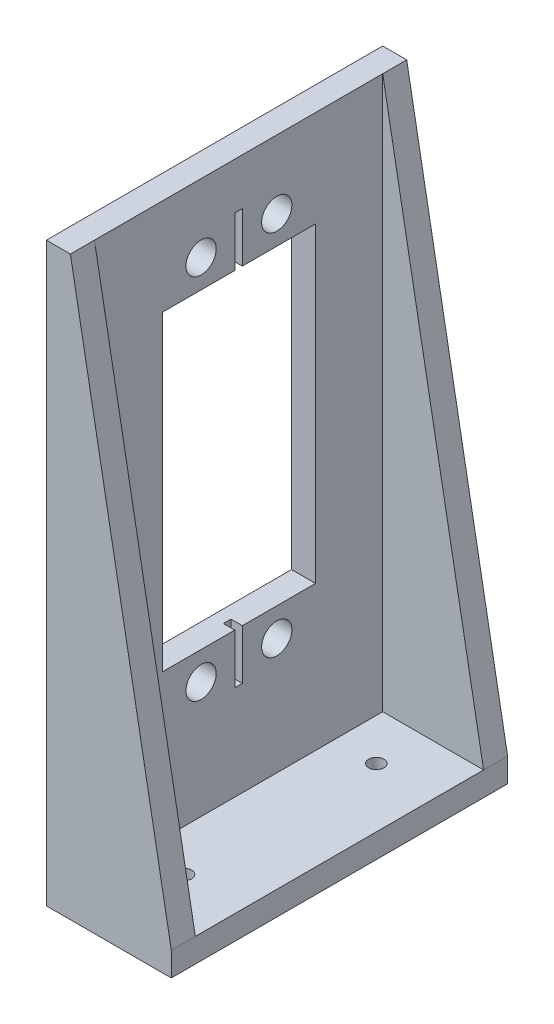
ISO-10303-21;
HEADER;
FILE_DESCRIPTION(('STEP AP214'),'2;1');
FILE_NAME('part.step','',(''),(''),'','','');
FILE_SCHEMA(('AUTOMOTIVE_DESIGN { 1 0 10303 214 1 1 1 1 }'));
ENDSEC;
DATA;
#1=APPLICATION_CONTEXT('core data for automotive mechanical design processes');
#2=APPLICATION_PROTOCOL_DEFINITION('international standard','automotive_design',2000,#1);
#3=PRODUCT_CONTEXT('',#1,'mechanical');
#4=PRODUCT('Part','Part','',(#3));
#5=PRODUCT_RELATED_PRODUCT_CATEGORY('part','',(#4));
#6=PRODUCT_DEFINITION_FORMATION('','',#4);
#7=PRODUCT_DEFINITION_CONTEXT('part definition',#1,'design');
#8=PRODUCT_DEFINITION('design','',#6,#7);
#9=PRODUCT_DEFINITION_SHAPE('','',#8);
#10=(LENGTH_UNIT() NAMED_UNIT(*) SI_UNIT(.MILLI.,.METRE.));
#11=(NAMED_UNIT(*) PLANE_ANGLE_UNIT() SI_UNIT($,.RADIAN.));
#12=(NAMED_UNIT(*) SI_UNIT($,.STERADIAN.) SOLID_ANGLE_UNIT());
#13=UNCERTAINTY_MEASURE_WITH_UNIT(LENGTH_MEASURE(1.E-05),#10,'distance_accuracy_value','');
#14=(GEOMETRIC_REPRESENTATION_CONTEXT(3) GLOBAL_UNCERTAINTY_ASSIGNED_CONTEXT((#13)) GLOBAL_UNIT_ASSIGNED_CONTEXT((#10,
#11,#12)) REPRESENTATION_CONTEXT('',''));
#15=CARTESIAN_POINT('',(0.,0.,0.));
#16=DIRECTION('',(0.,0.,1.));
#17=DIRECTION('',(1.,0.,0.));
#18=AXIS2_PLACEMENT_3D('',#15,#16,#17);
#19=CARTESIAN_POINT('',(3.175,3.175,22.225));
#20=DIRECTION('',(0.,-1.,0.));
#21=DIRECTION('',(1.,0.,0.));
#22=AXIS2_PLACEMENT_3D('',#19,#20,#21);
#23=PLANE('',#22);
#24=CARTESIAN_POINT('',(8.67999991199999,3.175,-12.7));
#25=DIRECTION('',(0.,1.,0.));
#26=DIRECTION('',(-1.,0.,0.));
#27=AXIS2_PLACEMENT_3D('',#24,#25,#26);
#28=CIRCLE('',#27,1.000000032);
#29=CARTESIAN_POINT('',(7.67999987999999,3.175,-12.7));
#30=VERTEX_POINT('',#29);
#31=EDGE_CURVE('E307',#30,#30,#28,.T.);
#32=ORIENTED_EDGE('',*,*,#31,.F.);
#33=EDGE_LOOP('',(#32));
#34=FACE_BOUND('',#33,.T.);
#35=CARTESIAN_POINT('',(8.67999991199999,3.175,12.7));
#36=DIRECTION('',(0.,1.,0.));
#37=DIRECTION('',(1.,0.,0.));
#38=AXIS2_PLACEMENT_3D('',#35,#36,#37);
#39=CIRCLE('',#38,1.000000032);
#40=CARTESIAN_POINT('',(9.679999944,3.175,12.7));
#41=VERTEX_POINT('',#40);
#42=EDGE_CURVE('E310',#41,#41,#39,.T.);
#43=ORIENTED_EDGE('',*,*,#42,.F.);
#44=EDGE_LOOP('',(#43));
#45=FACE_BOUND('',#44,.T.);
#46=DIRECTION('',(1.,0.,0.));
#47=VECTOR('',#46,1.);
#48=CARTESIAN_POINT('',(16.51,3.175,-19.05));
#49=LINE('',#48,#47);
#50=CARTESIAN_POINT('',(3.175,3.175,-19.05));
#51=VERTEX_POINT('',#50);
#52=CARTESIAN_POINT('',(16.51,3.175,-19.05));
#53=VERTEX_POINT('',#52);
#54=EDGE_CURVE('E321',#51,#53,#49,.T.);
#55=ORIENTED_EDGE('',*,*,#54,.F.);
#56=DIRECTION('',(0.,0.,-1.));
#57=VECTOR('',#56,1.);
#58=CARTESIAN_POINT('',(3.175,3.175,22.225));
#59=LINE('',#58,#57);
#60=CARTESIAN_POINT('',(3.175,3.175,19.05));
#61=VERTEX_POINT('',#60);
#62=EDGE_CURVE('E372',#61,#51,#59,.T.);
#63=ORIENTED_EDGE('',*,*,#62,.F.);
#64=DIRECTION('',(1.,0.,0.));
#65=VECTOR('',#64,1.);
#66=CARTESIAN_POINT('',(16.51,3.175,19.05));
#67=LINE('',#66,#65);
#68=CARTESIAN_POINT('',(16.51,3.175,19.05));
#69=VERTEX_POINT('',#68);
#70=EDGE_CURVE('E335',#61,#69,#67,.T.);
#71=ORIENTED_EDGE('',*,*,#70,.T.);
#72=DIRECTION('',(0.,0.,-1.));
#73=VECTOR('',#72,1.);
#74=CARTESIAN_POINT('',(16.51,3.175,22.225));
#75=LINE('',#74,#73);
#76=EDGE_CURVE('E374',#69,#53,#75,.T.);
#77=ORIENTED_EDGE('',*,*,#76,.T.);
#78=EDGE_LOOP('',(#55,#63,#71,#77));
#79=FACE_BOUND('',#78,.T.);
#80=ADVANCED_FACE('F38',(#34,#45,#79),#23,.F.);
#81=CARTESIAN_POINT('',(3.175,76.2,22.225));
#82=DIRECTION('',(-1.,0.,0.));
#83=DIRECTION('',(0.,-1.,0.));
#84=AXIS2_PLACEMENT_3D('',#81,#82,#83);
#85=PLANE('',#84);
#86=DIRECTION('',(0.,0.,-1.));
#87=VECTOR('',#86,1.);
#88=CARTESIAN_POINT('',(3.175,15.693999981,10.079999906));
#89=LINE('',#88,#87);
#90=CARTESIAN_POINT('',(3.175,15.693999981,0.500000016));
#91=VERTEX_POINT('',#90);
#92=CARTESIAN_POINT('',(3.175,15.693999981,-0.500000016));
#93=VERTEX_POINT('',#92);
#94=EDGE_CURVE('E194',#91,#93,#89,.T.);
#95=ORIENTED_EDGE('',*,*,#94,.F.);
#96=DIRECTION('',(0.,1.,0.));
#97=VECTOR('',#96,1.);
#98=CARTESIAN_POINT('',(3.175,15.693999981,0.500000016));
#99=LINE('',#98,#97);
#100=CARTESIAN_POINT('',(3.175,22.297999981,0.500000016));
#101=VERTEX_POINT('',#100);
#102=EDGE_CURVE('E177',#91,#101,#99,.T.);
#103=ORIENTED_EDGE('',*,*,#102,.T.);
#104=DIRECTION('',(0.,0.,-1.));
#105=VECTOR('',#104,1.);
#106=CARTESIAN_POINT('',(3.175,22.297999981,10.079999906));
#107=LINE('',#106,#105);
#108=CARTESIAN_POINT('',(3.175,22.297999981,10.079999906));
#109=VERTEX_POINT('',#108);
#110=EDGE_CURVE('E260',#109,#101,#107,.T.);
#111=ORIENTED_EDGE('',*,*,#110,.F.);
#112=DIRECTION('',(0.,-1.,0.));
#113=VECTOR('',#112,1.);
#114=CARTESIAN_POINT('',(3.175,63.451999969,10.079999906));
#115=LINE('',#114,#113);
#116=CARTESIAN_POINT('',(3.175,63.451999969,10.079999906));
#117=VERTEX_POINT('',#116);
#118=EDGE_CURVE('E238',#117,#109,#115,.T.);
#119=ORIENTED_EDGE('',*,*,#118,.F.);
#120=DIRECTION('',(0.,0.,1.));
#121=VECTOR('',#120,1.);
#122=CARTESIAN_POINT('',(3.175,63.451999969,10.079999906));
#123=LINE('',#122,#121);
#124=CARTESIAN_POINT('',(3.175,63.451999969,0.500000016));
#125=VERTEX_POINT('',#124);
#126=EDGE_CURVE('E265',#125,#117,#123,.T.);
#127=ORIENTED_EDGE('',*,*,#126,.F.);
#128=DIRECTION('',(0.,-1.,0.));
#129=VECTOR('',#128,1.);
#130=CARTESIAN_POINT('',(3.175,70.055999969,0.500000016));
#131=LINE('',#130,#129);
#132=CARTESIAN_POINT('',(3.175,70.055999969,0.500000016));
#133=VERTEX_POINT('',#132);
#134=EDGE_CURVE('E61',#133,#125,#131,.T.);
#135=ORIENTED_EDGE('',*,*,#134,.F.);
#136=DIRECTION('',(0.,0.,1.));
#137=VECTOR('',#136,1.);
#138=CARTESIAN_POINT('',(3.175,70.055999969,-0.500000016));
#139=LINE('',#138,#137);
#140=CARTESIAN_POINT('',(3.175,70.055999969,-0.500000016));
#141=VERTEX_POINT('',#140);
#142=EDGE_CURVE('E217',#141,#133,#139,.T.);
#143=ORIENTED_EDGE('',*,*,#142,.F.);
#144=DIRECTION('',(0.,-1.,0.));
#145=VECTOR('',#144,1.);
#146=CARTESIAN_POINT('',(3.175,70.055999969,-0.500000016));
#147=LINE('',#146,#145);
#148=CARTESIAN_POINT('',(3.175,63.451999969,-0.500000016));
#149=VERTEX_POINT('',#148);
#150=EDGE_CURVE('E235',#141,#149,#147,.T.);
#151=ORIENTED_EDGE('',*,*,#150,.T.);
#152=CARTESIAN_POINT('',(3.175,63.451999969,-10.173999972));
#153=VERTEX_POINT('',#152);
#154=EDGE_CURVE('E248',#153,#149,#123,.T.);
#155=ORIENTED_EDGE('',*,*,#154,.F.);
#156=DIRECTION('',(0.,1.,0.));
#157=VECTOR('',#156,1.);
#158=CARTESIAN_POINT('',(3.175,63.451999969,-10.173999972));
#159=LINE('',#158,#157);
#160=CARTESIAN_POINT('',(3.175,22.297999981,-10.173999972));
#161=VERTEX_POINT('',#160);
#162=EDGE_CURVE('E262',#161,#153,#159,.T.);
#163=ORIENTED_EDGE('',*,*,#162,.F.);
#164=CARTESIAN_POINT('',(3.175,22.297999981,-0.500000016));
#165=VERTEX_POINT('',#164);
#166=EDGE_CURVE('E259',#165,#161,#107,.T.);
#167=ORIENTED_EDGE('',*,*,#166,.F.);
#168=DIRECTION('',(0.,1.,0.));
#169=VECTOR('',#168,1.);
#170=CARTESIAN_POINT('',(3.175,15.693999981,-0.500000016));
#171=LINE('',#170,#169);
#172=EDGE_CURVE('E53',#93,#165,#171,.T.);
#173=ORIENTED_EDGE('',*,*,#172,.F.);
#174=EDGE_LOOP('',(#95,#103,#111,#119,#127,#135,#143,#151,#155,#163,#167,#173));
#175=FACE_BOUND('',#174,.T.);
#176=CARTESIAN_POINT('',(3.175,18.574999934,-5.047000066));
#177=DIRECTION('',(1.,0.,0.));
#178=DIRECTION('',(0.,1.,0.));
#179=AXIS2_PLACEMENT_3D('',#176,#177,#178);
#180=CIRCLE('',#179,2.000000064);
#181=CARTESIAN_POINT('',(3.175,20.574999998,-5.047000066));
#182=VERTEX_POINT('',#181);
#183=EDGE_CURVE('E285',#182,#182,#180,.T.);
#184=ORIENTED_EDGE('',*,*,#183,.F.);
#185=EDGE_LOOP('',(#184));
#186=FACE_BOUND('',#185,.T.);
#187=CARTESIAN_POINT('',(3.175,67.175000016,4.953));
#188=DIRECTION('',(1.,0.,0.));
#189=DIRECTION('',(0.,1.,0.));
#190=AXIS2_PLACEMENT_3D('',#187,#188,#189);
#191=CIRCLE('',#190,2.000000064);
#192=CARTESIAN_POINT('',(3.175,69.17500008,4.953));
#193=VERTEX_POINT('',#192);
#194=EDGE_CURVE('E292',#193,#193,#191,.T.);
#195=ORIENTED_EDGE('',*,*,#194,.F.);
#196=EDGE_LOOP('',(#195));
#197=FACE_BOUND('',#196,.T.);
#198=CARTESIAN_POINT('',(3.175,67.175000016,-5.047000066));
#199=DIRECTION('',(1.,0.,0.));
#200=DIRECTION('',(0.,1.,0.));
#201=AXIS2_PLACEMENT_3D('',#198,#199,#200);
#202=CIRCLE('',#201,2.000000064);
#203=CARTESIAN_POINT('',(3.175,69.17500008,-5.047000066));
#204=VERTEX_POINT('',#203);
#205=EDGE_CURVE('E279',#204,#204,#202,.T.);
#206=ORIENTED_EDGE('',*,*,#205,.F.);
#207=EDGE_LOOP('',(#206));
#208=FACE_BOUND('',#207,.T.);
#209=CARTESIAN_POINT('',(3.175,18.574999934,4.953));
#210=DIRECTION('',(1.,0.,0.));
#211=DIRECTION('',(0.,1.,0.));
#212=AXIS2_PLACEMENT_3D('',#209,#210,#211);
#213=CIRCLE('',#212,2.000000064);
#214=CARTESIAN_POINT('',(3.175,20.574999998,4.953));
#215=VERTEX_POINT('',#214);
#216=EDGE_CURVE('E288',#215,#215,#213,.T.);
#217=ORIENTED_EDGE('',*,*,#216,.F.);
#218=EDGE_LOOP('',(#217));
#219=FACE_BOUND('',#218,.T.);
#220=DIRECTION('',(0.,-1.,0.));
#221=VECTOR('',#220,1.);
#222=CARTESIAN_POINT('',(3.175,3.175,-19.05));
#223=LINE('',#222,#221);
#224=CARTESIAN_POINT('',(3.175,76.2,-19.05));
#225=VERTEX_POINT('',#224);
#226=EDGE_CURVE('E315',#225,#51,#223,.T.);
#227=ORIENTED_EDGE('',*,*,#226,.F.);
#228=DIRECTION('',(0.,0.,-1.));
#229=VECTOR('',#228,1.);
#230=CARTESIAN_POINT('',(3.175,76.2,22.225));
#231=LINE('',#230,#229);
#232=CARTESIAN_POINT('',(3.175,76.2,19.05));
#233=VERTEX_POINT('',#232);
#234=EDGE_CURVE('E368',#233,#225,#231,.T.);
#235=ORIENTED_EDGE('',*,*,#234,.F.);
#236=DIRECTION('',(0.,-1.,0.));
#237=VECTOR('',#236,1.);
#238=CARTESIAN_POINT('',(3.175,3.175,19.05));
#239=LINE('',#238,#237);
#240=EDGE_CURVE('E332',#233,#61,#239,.T.);
#241=ORIENTED_EDGE('',*,*,#240,.T.);
#242=ORIENTED_EDGE('',*,*,#62,.T.);
#243=EDGE_LOOP('',(#227,#235,#241,#242));
#244=FACE_BOUND('',#243,.T.);
#245=ADVANCED_FACE('F198',(#175,#186,#197,#208,#219,#244),#85,.F.);
#246=CARTESIAN_POINT('',(16.51,0.,22.225));
#247=DIRECTION('',(0.,1.,0.));
#248=DIRECTION('',(-1.,0.,0.));
#249=AXIS2_PLACEMENT_3D('',#246,#247,#248);
#250=PLANE('',#249);
#251=CARTESIAN_POINT('',(8.67999991199999,0.,-12.7));
#252=DIRECTION('',(0.,1.,0.));
#253=DIRECTION('',(-1.,0.,0.));
#254=AXIS2_PLACEMENT_3D('',#251,#252,#253);
#255=CIRCLE('',#254,1.000000032);
#256=CARTESIAN_POINT('',(7.67999987999999,0.,-12.7));
#257=VERTEX_POINT('',#256);
#258=EDGE_CURVE('E303',#257,#257,#255,.T.);
#259=ORIENTED_EDGE('',*,*,#258,.T.);
#260=EDGE_LOOP('',(#259));
#261=FACE_BOUND('',#260,.T.);
#262=CARTESIAN_POINT('',(8.67999991199999,0.,12.7));
#263=DIRECTION('',(0.,1.,0.));
#264=DIRECTION('',(1.,0.,0.));
#265=AXIS2_PLACEMENT_3D('',#262,#263,#264);
#266=CIRCLE('',#265,1.000000032);
#267=CARTESIAN_POINT('',(9.679999944,0.,12.7));
#268=VERTEX_POINT('',#267);
#269=EDGE_CURVE('E300',#268,#268,#266,.T.);
#270=ORIENTED_EDGE('',*,*,#269,.T.);
#271=EDGE_LOOP('',(#270));
#272=FACE_BOUND('',#271,.T.);
#273=DIRECTION('',(1.,0.,0.));
#274=VECTOR('',#273,1.);
#275=CARTESIAN_POINT('',(16.51,0.,-22.225));
#276=LINE('',#275,#274);
#277=CARTESIAN_POINT('',(0.,0.,-22.225));
#278=VERTEX_POINT('',#277);
#279=CARTESIAN_POINT('',(16.51,0.,-22.225));
#280=VERTEX_POINT('',#279);
#281=EDGE_CURVE('E341',#278,#280,#276,.T.);
#282=ORIENTED_EDGE('',*,*,#281,.T.);
#283=DIRECTION('',(0.,0.,-1.));
#284=VECTOR('',#283,1.);
#285=CARTESIAN_POINT('',(16.51,0.,22.225));
#286=LINE('',#285,#284);
#287=CARTESIAN_POINT('',(16.51,0.,22.225));
#288=VERTEX_POINT('',#287);
#289=EDGE_CURVE('E11',#288,#280,#286,.T.);
#290=ORIENTED_EDGE('',*,*,#289,.F.);
#291=DIRECTION('',(1.,0.,0.));
#292=VECTOR('',#291,1.);
#293=CARTESIAN_POINT('',(16.51,0.,22.225));
#294=LINE('',#293,#292);
#295=CARTESIAN_POINT('',(0.,0.,22.225));
#296=VERTEX_POINT('',#295);
#297=EDGE_CURVE('E344',#296,#288,#294,.T.);
#298=ORIENTED_EDGE('',*,*,#297,.F.);
#299=DIRECTION('',(0.,0.,-1.));
#300=VECTOR('',#299,1.);
#301=CARTESIAN_POINT('',(0.,0.,22.225));
#302=LINE('',#301,#300);
#303=EDGE_CURVE('E355',#296,#278,#302,.T.);
#304=ORIENTED_EDGE('',*,*,#303,.T.);
#305=EDGE_LOOP('',(#282,#290,#298,#304));
#306=FACE_BOUND('',#305,.T.);
#307=ADVANCED_FACE('F40',(#261,#272,#306),#250,.F.);
#308=CARTESIAN_POINT('',(16.51,3.175,22.225));
#309=DIRECTION('',(-1.,0.,0.));
#310=DIRECTION('',(0.,0.,1.));
#311=AXIS2_PLACEMENT_3D('',#308,#309,#310);
#312=PLANE('',#311);
#313=DIRECTION('',(0.,1.,0.));
#314=VECTOR('',#313,1.);
#315=CARTESIAN_POINT('',(16.51,3.175,-22.225));
#316=LINE('',#315,#314);
#317=CARTESIAN_POINT('',(16.51,3.175,-22.225));
#318=VERTEX_POINT('',#317);
#319=EDGE_CURVE('E358',#280,#318,#316,.T.);
#320=ORIENTED_EDGE('',*,*,#319,.T.);
#321=DIRECTION('',(0.,0.,-1.));
#322=VECTOR('',#321,1.);
#323=CARTESIAN_POINT('',(16.51,3.175,-19.05));
#324=LINE('',#323,#322);
#325=EDGE_CURVE('E327',#53,#318,#324,.T.);
#326=ORIENTED_EDGE('',*,*,#325,.F.);
#327=ORIENTED_EDGE('',*,*,#76,.F.);
#328=CARTESIAN_POINT('',(16.51,3.175,22.225));
#329=VERTEX_POINT('',#328);
#330=EDGE_CURVE('E46',#329,#69,#75,.T.);
#331=ORIENTED_EDGE('',*,*,#330,.F.);
#332=DIRECTION('',(0.,1.,0.));
#333=VECTOR('',#332,1.);
#334=CARTESIAN_POINT('',(16.51,3.175,22.225));
#335=LINE('',#334,#333);
#336=EDGE_CURVE('E347',#288,#329,#335,.T.);
#337=ORIENTED_EDGE('',*,*,#336,.F.);
#338=ORIENTED_EDGE('',*,*,#289,.T.);
#339=EDGE_LOOP('',(#320,#326,#327,#331,#337,#338));
#340=FACE_BOUND('',#339,.T.);
#341=ADVANCED_FACE('F432',(#340),#312,.F.);
#342=CARTESIAN_POINT('',(0.,76.2,22.225));
#343=DIRECTION('',(0.,-1.,0.));
#344=DIRECTION('',(0.,0.,-1.));
#345=AXIS2_PLACEMENT_3D('',#342,#343,#344);
#346=PLANE('',#345);
#347=DIRECTION('',(-1.,0.,0.));
#348=VECTOR('',#347,1.);
#349=CARTESIAN_POINT('',(0.,76.2,-22.225));
#350=LINE('',#349,#348);
#351=CARTESIAN_POINT('',(3.175,76.2,-22.225));
#352=VERTEX_POINT('',#351);
#353=CARTESIAN_POINT('',(0.,76.2,-22.225));
#354=VERTEX_POINT('',#353);
#355=EDGE_CURVE('E360',#352,#354,#350,.T.);
#356=ORIENTED_EDGE('',*,*,#355,.T.);
#357=DIRECTION('',(0.,0.,-1.));
#358=VECTOR('',#357,1.);
#359=CARTESIAN_POINT('',(0.,76.2,22.225));
#360=LINE('',#359,#358);
#361=CARTESIAN_POINT('',(0.,76.2,22.225));
#362=VERTEX_POINT('',#361);
#363=EDGE_CURVE('E365',#362,#354,#360,.T.);
#364=ORIENTED_EDGE('',*,*,#363,.F.);
#365=DIRECTION('',(-1.,0.,0.));
#366=VECTOR('',#365,1.);
#367=CARTESIAN_POINT('',(0.,76.2,22.225));
#368=LINE('',#367,#366);
#369=CARTESIAN_POINT('',(3.175,76.2,22.225));
#370=VERTEX_POINT('',#369);
#371=EDGE_CURVE('E351',#370,#362,#368,.T.);
#372=ORIENTED_EDGE('',*,*,#371,.F.);
#373=EDGE_CURVE('E369',#370,#233,#231,.T.);
#374=ORIENTED_EDGE('',*,*,#373,.T.);
#375=ORIENTED_EDGE('',*,*,#234,.T.);
#376=DIRECTION('',(0.,0.,-1.));
#377=VECTOR('',#376,1.);
#378=CARTESIAN_POINT('',(3.175,76.2,-19.05));
#379=LINE('',#378,#377);
#380=EDGE_CURVE('E324',#225,#352,#379,.T.);
#381=ORIENTED_EDGE('',*,*,#380,.T.);
#382=EDGE_LOOP('',(#356,#364,#372,#374,#375,#381));
#383=FACE_BOUND('',#382,.T.);
#384=ADVANCED_FACE('F393',(#383),#346,.F.);
#385=CARTESIAN_POINT('',(0.,0.,22.225));
#386=DIRECTION('',(1.,0.,0.));
#387=DIRECTION('',(0.,0.,-1.));
#388=AXIS2_PLACEMENT_3D('',#385,#386,#387);
#389=PLANE('',#388);
#390=DIRECTION('',(0.,0.,1.));
#391=VECTOR('',#390,1.);
#392=CARTESIAN_POINT('',(0.,63.451999969,10.079999906));
#393=LINE('',#392,#391);
#394=CARTESIAN_POINT('',(0.,63.451999969,-10.173999972));
#395=VERTEX_POINT('',#394);
#396=CARTESIAN_POINT('',(0.,63.451999969,10.079999906));
#397=VERTEX_POINT('',#396);
#398=EDGE_CURVE('E254',#395,#397,#393,.T.);
#399=ORIENTED_EDGE('',*,*,#398,.T.);
#400=DIRECTION('',(0.,-1.,0.));
#401=VECTOR('',#400,1.);
#402=CARTESIAN_POINT('',(0.,63.451999969,10.079999906));
#403=LINE('',#402,#401);
#404=CARTESIAN_POINT('',(0.,22.297999981,10.079999906));
#405=VERTEX_POINT('',#404);
#406=EDGE_CURVE('E244',#397,#405,#403,.T.);
#407=ORIENTED_EDGE('',*,*,#406,.T.);
#408=DIRECTION('',(0.,0.,-1.));
#409=VECTOR('',#408,1.);
#410=CARTESIAN_POINT('',(0.,22.297999981,10.079999906));
#411=LINE('',#410,#409);
#412=CARTESIAN_POINT('',(0.,22.297999981,-10.173999972));
#413=VERTEX_POINT('',#412);
#414=EDGE_CURVE('E247',#405,#413,#411,.T.);
#415=ORIENTED_EDGE('',*,*,#414,.T.);
#416=DIRECTION('',(0.,1.,0.));
#417=VECTOR('',#416,1.);
#418=CARTESIAN_POINT('',(0.,63.451999969,-10.173999972));
#419=LINE('',#418,#417);
#420=EDGE_CURVE('E251',#413,#395,#419,.T.);
#421=ORIENTED_EDGE('',*,*,#420,.T.);
#422=EDGE_LOOP('',(#399,#407,#415,#421));
#423=FACE_BOUND('',#422,.T.);
#424=CARTESIAN_POINT('',(0.,18.574999934,-5.047000066));
#425=DIRECTION('',(1.,0.,0.));
#426=DIRECTION('',(0.,1.,0.));
#427=AXIS2_PLACEMENT_3D('',#424,#425,#426);
#428=CIRCLE('',#427,2.000000064);
#429=CARTESIAN_POINT('',(0.,20.574999998,-5.047000066));
#430=VERTEX_POINT('',#429);
#431=EDGE_CURVE('E289',#430,#430,#428,.T.);
#432=ORIENTED_EDGE('',*,*,#431,.T.);
#433=EDGE_LOOP('',(#432));
#434=FACE_BOUND('',#433,.T.);
#435=CARTESIAN_POINT('',(0.,67.175000016,4.953));
#436=DIRECTION('',(1.,0.,0.));
#437=DIRECTION('',(0.,1.,0.));
#438=AXIS2_PLACEMENT_3D('',#435,#436,#437);
#439=CIRCLE('',#438,2.000000064);
#440=CARTESIAN_POINT('',(0.,69.17500008,4.953));
#441=VERTEX_POINT('',#440);
#442=EDGE_CURVE('E282',#441,#441,#439,.T.);
#443=ORIENTED_EDGE('',*,*,#442,.T.);
#444=EDGE_LOOP('',(#443));
#445=FACE_BOUND('',#444,.T.);
#446=CARTESIAN_POINT('',(0.,67.175000016,-5.047000066));
#447=DIRECTION('',(1.,0.,0.));
#448=DIRECTION('',(0.,1.,0.));
#449=AXIS2_PLACEMENT_3D('',#446,#447,#448);
#450=CIRCLE('',#449,2.000000064);
#451=CARTESIAN_POINT('',(0.,69.17500008,-5.047000066));
#452=VERTEX_POINT('',#451);
#453=EDGE_CURVE('E271',#452,#452,#450,.T.);
#454=ORIENTED_EDGE('',*,*,#453,.T.);
#455=EDGE_LOOP('',(#454));
#456=FACE_BOUND('',#455,.T.);
#457=CARTESIAN_POINT('',(0.,18.574999934,4.953));
#458=DIRECTION('',(1.,0.,0.));
#459=DIRECTION('',(0.,1.,0.));
#460=AXIS2_PLACEMENT_3D('',#457,#458,#459);
#461=CIRCLE('',#460,2.000000064);
#462=CARTESIAN_POINT('',(0.,20.574999998,4.953));
#463=VERTEX_POINT('',#462);
#464=EDGE_CURVE('E297',#463,#463,#461,.T.);
#465=ORIENTED_EDGE('',*,*,#464,.T.);
#466=EDGE_LOOP('',(#465));
#467=FACE_BOUND('',#466,.T.);
#468=DIRECTION('',(0.,-1.,0.));
#469=VECTOR('',#468,1.);
#470=CARTESIAN_POINT('',(0.,0.,-22.225));
#471=LINE('',#470,#469);
#472=EDGE_CURVE('E348',#354,#278,#471,.T.);
#473=ORIENTED_EDGE('',*,*,#472,.T.);
#474=ORIENTED_EDGE('',*,*,#303,.F.);
#475=DIRECTION('',(0.,-1.,0.));
#476=VECTOR('',#475,1.);
#477=CARTESIAN_POINT('',(0.,0.,22.225));
#478=LINE('',#477,#476);
#479=EDGE_CURVE('E353',#362,#296,#478,.T.);
#480=ORIENTED_EDGE('',*,*,#479,.F.);
#481=ORIENTED_EDGE('',*,*,#363,.T.);
#482=EDGE_LOOP('',(#473,#474,#480,#481));
#483=FACE_BOUND('',#482,.T.);
#484=ADVANCED_FACE('F402',(#423,#434,#445,#456,#467,#483),#389,.F.);
#485=CARTESIAN_POINT('',(0.,0.,22.225));
#486=DIRECTION('',(0.,0.,-1.));
#487=DIRECTION('',(-1.,0.,0.));
#488=AXIS2_PLACEMENT_3D('',#485,#486,#487);
#489=PLANE('',#488);
#490=DIRECTION('',(-0.179638155253197,0.983732754957986,0.));
#491=VECTOR('',#490,1.);
#492=CARTESIAN_POINT('',(3.175,76.2,22.225));
#493=LINE('',#492,#491);
#494=EDGE_CURVE('E330',#329,#370,#493,.T.);
#495=ORIENTED_EDGE('',*,*,#494,.T.);
#496=ORIENTED_EDGE('',*,*,#371,.T.);
#497=ORIENTED_EDGE('',*,*,#479,.T.);
#498=ORIENTED_EDGE('',*,*,#297,.T.);
#499=ORIENTED_EDGE('',*,*,#336,.T.);
#500=EDGE_LOOP('',(#495,#496,#497,#498,#499));
#501=FACE_BOUND('',#500,.T.);
#502=ADVANCED_FACE('F408',(#501),#489,.F.);
#503=CARTESIAN_POINT('',(0.,0.,-22.225));
#504=DIRECTION('',(0.,0.,-1.));
#505=DIRECTION('',(-1.,0.,0.));
#506=AXIS2_PLACEMENT_3D('',#503,#504,#505);
#507=PLANE('',#506);
#508=ORIENTED_EDGE('',*,*,#355,.F.);
#509=DIRECTION('',(-0.179638155253197,0.983732754957986,0.));
#510=VECTOR('',#509,1.);
#511=CARTESIAN_POINT('',(3.175,76.2,-22.225));
#512=LINE('',#511,#510);
#513=EDGE_CURVE('E306',#318,#352,#512,.T.);
#514=ORIENTED_EDGE('',*,*,#513,.F.);
#515=ORIENTED_EDGE('',*,*,#319,.F.);
#516=ORIENTED_EDGE('',*,*,#281,.F.);
#517=ORIENTED_EDGE('',*,*,#472,.F.);
#518=EDGE_LOOP('',(#508,#514,#515,#516,#517));
#519=FACE_BOUND('',#518,.T.);
#520=ADVANCED_FACE('F398',(#519),#507,.T.);
#521=CARTESIAN_POINT('',(3.175,76.2,19.05));
#522=DIRECTION('',(0.983732754957986,0.179638155253197,0.));
#523=DIRECTION('',(-0.179638155253197,0.983732754957986,0.));
#524=AXIS2_PLACEMENT_3D('',#521,#522,#523);
#525=PLANE('',#524);
#526=ORIENTED_EDGE('',*,*,#494,.F.);
#527=ORIENTED_EDGE('',*,*,#330,.T.);
#528=DIRECTION('',(-0.179638155253197,0.983732754957986,0.));
#529=VECTOR('',#528,1.);
#530=CARTESIAN_POINT('',(3.175,76.2,19.05));
#531=LINE('',#530,#529);
#532=EDGE_CURVE('E338',#69,#233,#531,.T.);
#533=ORIENTED_EDGE('',*,*,#532,.T.);
#534=ORIENTED_EDGE('',*,*,#373,.F.);
#535=EDGE_LOOP('',(#526,#527,#533,#534));
#536=FACE_BOUND('',#535,.T.);
#537=ADVANCED_FACE('F410',(#536),#525,.T.);
#538=CARTESIAN_POINT('',(0.,0.,19.05));
#539=DIRECTION('',(0.,0.,1.));
#540=DIRECTION('',(1.,0.,0.));
#541=AXIS2_PLACEMENT_3D('',#538,#539,#540);
#542=PLANE('',#541);
#543=ORIENTED_EDGE('',*,*,#240,.F.);
#544=ORIENTED_EDGE('',*,*,#532,.F.);
#545=ORIENTED_EDGE('',*,*,#70,.F.);
#546=EDGE_LOOP('',(#543,#544,#545));
#547=FACE_BOUND('',#546,.T.);
#548=ADVANCED_FACE('F413',(#547),#542,.F.);
#549=CARTESIAN_POINT('',(3.175,76.2,-19.05));
#550=DIRECTION('',(-0.983732754957986,-0.179638155253197,0.));
#551=DIRECTION('',(0.179638155253197,-0.983732754957986,0.));
#552=AXIS2_PLACEMENT_3D('',#549,#550,#551);
#553=PLANE('',#552);
#554=ORIENTED_EDGE('',*,*,#513,.T.);
#555=ORIENTED_EDGE('',*,*,#380,.F.);
#556=DIRECTION('',(-0.179638155253197,0.983732754957986,0.));
#557=VECTOR('',#556,1.);
#558=CARTESIAN_POINT('',(3.175,76.2,-19.05));
#559=LINE('',#558,#557);
#560=EDGE_CURVE('E318',#53,#225,#559,.T.);
#561=ORIENTED_EDGE('',*,*,#560,.F.);
#562=ORIENTED_EDGE('',*,*,#325,.T.);
#563=EDGE_LOOP('',(#554,#555,#561,#562));
#564=FACE_BOUND('',#563,.T.);
#565=ADVANCED_FACE('F388',(#564),#553,.F.);
#566=CARTESIAN_POINT('',(0.,0.,-19.05));
#567=DIRECTION('',(0.,0.,-1.));
#568=DIRECTION('',(1.,0.,0.));
#569=AXIS2_PLACEMENT_3D('',#566,#567,#568);
#570=PLANE('',#569);
#571=ORIENTED_EDGE('',*,*,#226,.T.);
#572=ORIENTED_EDGE('',*,*,#54,.T.);
#573=ORIENTED_EDGE('',*,*,#560,.T.);
#574=EDGE_LOOP('',(#571,#572,#573));
#575=FACE_BOUND('',#574,.T.);
#576=ADVANCED_FACE('F385',(#575),#570,.F.);
#577=CARTESIAN_POINT('',(8.67999991199999,0.,12.7));
#578=DIRECTION('',(0.,1.,0.));
#579=DIRECTION('',(-1.,0.,0.));
#580=AXIS2_PLACEMENT_3D('',#577,#578,#579);
#581=CYLINDRICAL_SURFACE('',#580,1.000000032);
#582=ORIENTED_EDGE('',*,*,#269,.F.);
#583=EDGE_LOOP('',(#582));
#584=FACE_BOUND('',#583,.T.);
#585=ORIENTED_EDGE('',*,*,#42,.T.);
#586=EDGE_LOOP('',(#585));
#587=FACE_BOUND('',#586,.T.);
#588=ADVANCED_FACE('F445',(#584,#587),#581,.F.);
#589=CARTESIAN_POINT('',(8.67999991199999,0.,-12.7));
#590=DIRECTION('',(0.,1.,0.));
#591=DIRECTION('',(-1.,0.,0.));
#592=AXIS2_PLACEMENT_3D('',#589,#590,#591);
#593=CYLINDRICAL_SURFACE('',#592,1.000000032);
#594=ORIENTED_EDGE('',*,*,#258,.F.);
#595=EDGE_LOOP('',(#594));
#596=FACE_BOUND('',#595,.T.);
#597=ORIENTED_EDGE('',*,*,#31,.T.);
#598=EDGE_LOOP('',(#597));
#599=FACE_BOUND('',#598,.T.);
#600=ADVANCED_FACE('F448',(#596,#599),#593,.F.);
#601=CARTESIAN_POINT('',(0.,18.574999934,4.953));
#602=DIRECTION('',(1.,0.,0.));
#603=DIRECTION('',(0.,1.,0.));
#604=AXIS2_PLACEMENT_3D('',#601,#602,#603);
#605=CYLINDRICAL_SURFACE('',#604,2.000000064);
#606=ORIENTED_EDGE('',*,*,#464,.F.);
#607=EDGE_LOOP('',(#606));
#608=FACE_BOUND('',#607,.T.);
#609=ORIENTED_EDGE('',*,*,#216,.T.);
#610=EDGE_LOOP('',(#609));
#611=FACE_BOUND('',#610,.T.);
#612=ADVANCED_FACE('F455',(#608,#611),#605,.F.);
#613=CARTESIAN_POINT('',(0.,67.175000016,-5.047000066));
#614=DIRECTION('',(1.,0.,0.));
#615=DIRECTION('',(0.,1.,0.));
#616=AXIS2_PLACEMENT_3D('',#613,#614,#615);
#617=CYLINDRICAL_SURFACE('',#616,2.000000064);
#618=ORIENTED_EDGE('',*,*,#453,.F.);
#619=EDGE_LOOP('',(#618));
#620=FACE_BOUND('',#619,.T.);
#621=ORIENTED_EDGE('',*,*,#205,.T.);
#622=EDGE_LOOP('',(#621));
#623=FACE_BOUND('',#622,.T.);
#624=ADVANCED_FACE('F462',(#620,#623),#617,.F.);
#625=CARTESIAN_POINT('',(0.,67.175000016,4.953));
#626=DIRECTION('',(1.,0.,0.));
#627=DIRECTION('',(0.,1.,0.));
#628=AXIS2_PLACEMENT_3D('',#625,#626,#627);
#629=CYLINDRICAL_SURFACE('',#628,2.000000064);
#630=ORIENTED_EDGE('',*,*,#442,.F.);
#631=EDGE_LOOP('',(#630));
#632=FACE_BOUND('',#631,.T.);
#633=ORIENTED_EDGE('',*,*,#194,.T.);
#634=EDGE_LOOP('',(#633));
#635=FACE_BOUND('',#634,.T.);
#636=ADVANCED_FACE('F464',(#632,#635),#629,.F.);
#637=CARTESIAN_POINT('',(0.,18.574999934,-5.047000066));
#638=DIRECTION('',(1.,0.,0.));
#639=DIRECTION('',(0.,1.,0.));
#640=AXIS2_PLACEMENT_3D('',#637,#638,#639);
#641=CYLINDRICAL_SURFACE('',#640,2.000000064);
#642=ORIENTED_EDGE('',*,*,#431,.F.);
#643=EDGE_LOOP('',(#642));
#644=FACE_BOUND('',#643,.T.);
#645=ORIENTED_EDGE('',*,*,#183,.T.);
#646=EDGE_LOOP('',(#645));
#647=FACE_BOUND('',#646,.T.);
#648=ADVANCED_FACE('F467',(#644,#647),#641,.F.);
#649=CARTESIAN_POINT('',(0.,63.451999969,10.079999906));
#650=DIRECTION('',(0.,0.,1.));
#651=DIRECTION('',(0.,-1.,0.));
#652=AXIS2_PLACEMENT_3D('',#649,#650,#651);
#653=PLANE('',#652);
#654=ORIENTED_EDGE('',*,*,#118,.T.);
#655=DIRECTION('',(1.,0.,0.));
#656=VECTOR('',#655,1.);
#657=CARTESIAN_POINT('',(0.,22.297999981,10.079999906));
#658=LINE('',#657,#656);
#659=EDGE_CURVE('E257',#405,#109,#658,.T.);
#660=ORIENTED_EDGE('',*,*,#659,.F.);
#661=ORIENTED_EDGE('',*,*,#406,.F.);
#662=DIRECTION('',(1.,0.,0.));
#663=VECTOR('',#662,1.);
#664=CARTESIAN_POINT('',(0.,63.451999969,10.079999906));
#665=LINE('',#664,#663);
#666=EDGE_CURVE('E268',#397,#117,#665,.T.);
#667=ORIENTED_EDGE('',*,*,#666,.T.);
#668=EDGE_LOOP('',(#654,#660,#661,#667));
#669=FACE_BOUND('',#668,.T.);
#670=ADVANCED_FACE('F471',(#669),#653,.F.);
#671=CARTESIAN_POINT('',(0.,63.451999969,10.079999906));
#672=DIRECTION('',(0.,1.,0.));
#673=DIRECTION('',(-1.,0.,0.));
#674=AXIS2_PLACEMENT_3D('',#671,#672,#673);
#675=PLANE('',#674);
#676=ORIENTED_EDGE('',*,*,#154,.T.);
#677=DIRECTION('',(1.,0.,0.));
#678=VECTOR('',#677,1.);
#679=CARTESIAN_POINT('',(1.674999952,63.451999969,-0.500000016));
#680=LINE('',#679,#678);
#681=CARTESIAN_POINT('',(1.674999952,63.451999969,-0.500000016));
#682=VERTEX_POINT('',#681);
#683=EDGE_CURVE('E221',#682,#149,#680,.T.);
#684=ORIENTED_EDGE('',*,*,#683,.F.);
#685=DIRECTION('',(0.,0.,-1.));
#686=VECTOR('',#685,1.);
#687=CARTESIAN_POINT('',(1.674999952,63.451999969,-0.500000016));
#688=LINE('',#687,#686);
#689=CARTESIAN_POINT('',(1.674999952,63.451999969,0.500000016));
#690=VERTEX_POINT('',#689);
#691=EDGE_CURVE('E231',#690,#682,#688,.T.);
#692=ORIENTED_EDGE('',*,*,#691,.F.);
#693=DIRECTION('',(-1.,0.,0.));
#694=VECTOR('',#693,1.);
#695=CARTESIAN_POINT('',(1.674999952,63.451999969,0.500000016));
#696=LINE('',#695,#694);
#697=EDGE_CURVE('E213',#125,#690,#696,.T.);
#698=ORIENTED_EDGE('',*,*,#697,.F.);
#699=ORIENTED_EDGE('',*,*,#126,.T.);
#700=ORIENTED_EDGE('',*,*,#666,.F.);
#701=ORIENTED_EDGE('',*,*,#398,.F.);
#702=DIRECTION('',(1.,0.,0.));
#703=VECTOR('',#702,1.);
#704=CARTESIAN_POINT('',(0.,63.451999969,-10.173999972));
#705=LINE('',#704,#703);
#706=EDGE_CURVE('E272',#395,#153,#705,.T.);
#707=ORIENTED_EDGE('',*,*,#706,.T.);
#708=EDGE_LOOP('',(#676,#684,#692,#698,#699,#700,#701,#707));
#709=FACE_BOUND('',#708,.T.);
#710=ADVANCED_FACE('F478',(#709),#675,.F.);
#711=CARTESIAN_POINT('',(0.,63.451999969,-10.173999972));
#712=DIRECTION('',(0.,0.,-1.));
#713=DIRECTION('',(0.,1.,0.));
#714=AXIS2_PLACEMENT_3D('',#711,#712,#713);
#715=PLANE('',#714);
#716=ORIENTED_EDGE('',*,*,#162,.T.);
#717=ORIENTED_EDGE('',*,*,#706,.F.);
#718=ORIENTED_EDGE('',*,*,#420,.F.);
#719=DIRECTION('',(1.,0.,0.));
#720=VECTOR('',#719,1.);
#721=CARTESIAN_POINT('',(0.,22.297999981,-10.173999972));
#722=LINE('',#721,#720);
#723=EDGE_CURVE('E274',#413,#161,#722,.T.);
#724=ORIENTED_EDGE('',*,*,#723,.T.);
#725=EDGE_LOOP('',(#716,#717,#718,#724));
#726=FACE_BOUND('',#725,.T.);
#727=ADVANCED_FACE('F484',(#726),#715,.F.);
#728=CARTESIAN_POINT('',(0.,22.297999981,10.079999906));
#729=DIRECTION('',(0.,-1.,0.));
#730=DIRECTION('',(1.,0.,0.));
#731=AXIS2_PLACEMENT_3D('',#728,#729,#730);
#732=PLANE('',#731);
#733=ORIENTED_EDGE('',*,*,#110,.T.);
#734=DIRECTION('',(1.,0.,0.));
#735=VECTOR('',#734,1.);
#736=CARTESIAN_POINT('',(0.,22.297999981,0.500000016));
#737=LINE('',#736,#735);
#738=CARTESIAN_POINT('',(1.674999952,22.297999981,0.500000016));
#739=VERTEX_POINT('',#738);
#740=EDGE_CURVE('E183',#739,#101,#737,.T.);
#741=ORIENTED_EDGE('',*,*,#740,.F.);
#742=DIRECTION('',(0.,0.,1.));
#743=VECTOR('',#742,1.);
#744=CARTESIAN_POINT('',(1.674999952,22.297999981,10.079999906));
#745=LINE('',#744,#743);
#746=CARTESIAN_POINT('',(1.674999952,22.297999981,-0.500000016));
#747=VERTEX_POINT('',#746);
#748=EDGE_CURVE('E196',#747,#739,#745,.T.);
#749=ORIENTED_EDGE('',*,*,#748,.F.);
#750=DIRECTION('',(-1.,0.,0.));
#751=VECTOR('',#750,1.);
#752=CARTESIAN_POINT('',(0.,22.297999981,-0.500000016));
#753=LINE('',#752,#751);
#754=EDGE_CURVE('E207',#165,#747,#753,.T.);
#755=ORIENTED_EDGE('',*,*,#754,.F.);
#756=ORIENTED_EDGE('',*,*,#166,.T.);
#757=ORIENTED_EDGE('',*,*,#723,.F.);
#758=ORIENTED_EDGE('',*,*,#414,.F.);
#759=ORIENTED_EDGE('',*,*,#659,.T.);
#760=EDGE_LOOP('',(#733,#741,#749,#755,#756,#757,#758,#759));
#761=FACE_BOUND('',#760,.T.);
#762=ADVANCED_FACE('F480',(#761),#732,.F.);
#763=CARTESIAN_POINT('',(1.674999952,70.055999969,-0.500000016));
#764=DIRECTION('',(0.,0.,-1.));
#765=DIRECTION('',(-1.,0.,0.));
#766=AXIS2_PLACEMENT_3D('',#763,#764,#765);
#767=PLANE('',#766);
#768=ORIENTED_EDGE('',*,*,#683,.T.);
#769=ORIENTED_EDGE('',*,*,#150,.F.);
#770=DIRECTION('',(1.,0.,0.));
#771=VECTOR('',#770,1.);
#772=CARTESIAN_POINT('',(1.674999952,70.055999969,-0.500000016));
#773=LINE('',#772,#771);
#774=CARTESIAN_POINT('',(1.674999952,70.055999969,-0.500000016));
#775=VERTEX_POINT('',#774);
#776=EDGE_CURVE('E227',#775,#141,#773,.T.);
#777=ORIENTED_EDGE('',*,*,#776,.F.);
#778=DIRECTION('',(0.,-1.,0.));
#779=VECTOR('',#778,1.);
#780=CARTESIAN_POINT('',(1.674999952,70.055999969,-0.500000016));
#781=LINE('',#780,#779);
#782=EDGE_CURVE('E239',#775,#682,#781,.T.);
#783=ORIENTED_EDGE('',*,*,#782,.T.);
#784=EDGE_LOOP('',(#768,#769,#777,#783));
#785=FACE_BOUND('',#784,.T.);
#786=ADVANCED_FACE('F483',(#785),#767,.F.);
#787=CARTESIAN_POINT('',(1.674999952,70.055999969,-0.500000016));
#788=DIRECTION('',(-1.,0.,0.));
#789=DIRECTION('',(0.,-1.,0.));
#790=AXIS2_PLACEMENT_3D('',#787,#788,#789);
#791=PLANE('',#790);
#792=ORIENTED_EDGE('',*,*,#691,.T.);
#793=ORIENTED_EDGE('',*,*,#782,.F.);
#794=DIRECTION('',(0.,0.,-1.));
#795=VECTOR('',#794,1.);
#796=CARTESIAN_POINT('',(1.674999952,70.055999969,-0.500000016));
#797=LINE('',#796,#795);
#798=CARTESIAN_POINT('',(1.674999952,70.055999969,0.500000016));
#799=VERTEX_POINT('',#798);
#800=EDGE_CURVE('E224',#799,#775,#797,.T.);
#801=ORIENTED_EDGE('',*,*,#800,.F.);
#802=DIRECTION('',(0.,-1.,0.));
#803=VECTOR('',#802,1.);
#804=CARTESIAN_POINT('',(1.674999952,70.055999969,0.500000016));
#805=LINE('',#804,#803);
#806=EDGE_CURVE('E241',#799,#690,#805,.T.);
#807=ORIENTED_EDGE('',*,*,#806,.T.);
#808=EDGE_LOOP('',(#792,#793,#801,#807));
#809=FACE_BOUND('',#808,.T.);
#810=ADVANCED_FACE('F496',(#809),#791,.F.);
#811=CARTESIAN_POINT('',(1.674999952,70.055999969,0.500000016));
#812=DIRECTION('',(0.,0.,1.));
#813=DIRECTION('',(1.,0.,0.));
#814=AXIS2_PLACEMENT_3D('',#811,#812,#813);
#815=PLANE('',#814);
#816=ORIENTED_EDGE('',*,*,#697,.T.);
#817=ORIENTED_EDGE('',*,*,#806,.F.);
#818=DIRECTION('',(-1.,0.,0.));
#819=VECTOR('',#818,1.);
#820=CARTESIAN_POINT('',(1.674999952,70.055999969,0.500000016));
#821=LINE('',#820,#819);
#822=EDGE_CURVE('E220',#133,#799,#821,.T.);
#823=ORIENTED_EDGE('',*,*,#822,.F.);
#824=ORIENTED_EDGE('',*,*,#134,.T.);
#825=EDGE_LOOP('',(#816,#817,#823,#824));
#826=FACE_BOUND('',#825,.T.);
#827=ADVANCED_FACE('F492',(#826),#815,.F.);
#828=CARTESIAN_POINT('',(0.,70.055999969,0.));
#829=DIRECTION('',(0.,1.,0.));
#830=DIRECTION('',(0.,0.,1.));
#831=AXIS2_PLACEMENT_3D('',#828,#829,#830);
#832=PLANE('',#831);
#833=ORIENTED_EDGE('',*,*,#142,.T.);
#834=ORIENTED_EDGE('',*,*,#822,.T.);
#835=ORIENTED_EDGE('',*,*,#800,.T.);
#836=ORIENTED_EDGE('',*,*,#776,.T.);
#837=EDGE_LOOP('',(#833,#834,#835,#836));
#838=FACE_BOUND('',#837,.T.);
#839=ADVANCED_FACE('F495',(#838),#832,.F.);
#840=CARTESIAN_POINT('',(0.,15.693999981,0.500000016));
#841=DIRECTION('',(0.,0.,1.));
#842=DIRECTION('',(1.,0.,0.));
#843=AXIS2_PLACEMENT_3D('',#840,#841,#842);
#844=PLANE('',#843);
#845=ORIENTED_EDGE('',*,*,#740,.T.);
#846=ORIENTED_EDGE('',*,*,#102,.F.);
#847=DIRECTION('',(1.,0.,0.));
#848=VECTOR('',#847,1.);
#849=CARTESIAN_POINT('',(0.,15.693999981,0.500000016));
#850=LINE('',#849,#848);
#851=CARTESIAN_POINT('',(1.674999952,15.693999981,0.500000016));
#852=VERTEX_POINT('',#851);
#853=EDGE_CURVE('E180',#852,#91,#850,.T.);
#854=ORIENTED_EDGE('',*,*,#853,.F.);
#855=DIRECTION('',(0.,1.,0.));
#856=VECTOR('',#855,1.);
#857=CARTESIAN_POINT('',(1.674999952,15.693999981,0.500000016));
#858=LINE('',#857,#856);
#859=EDGE_CURVE('E211',#852,#739,#858,.T.);
#860=ORIENTED_EDGE('',*,*,#859,.T.);
#861=EDGE_LOOP('',(#845,#846,#854,#860));
#862=FACE_BOUND('',#861,.T.);
#863=ADVANCED_FACE('F179',(#862),#844,.F.);
#864=CARTESIAN_POINT('',(1.674999952,15.693999981,10.079999906));
#865=DIRECTION('',(-1.,0.,0.));
#866=DIRECTION('',(0.,-1.,0.));
#867=AXIS2_PLACEMENT_3D('',#864,#865,#866);
#868=PLANE('',#867);
#869=ORIENTED_EDGE('',*,*,#748,.T.);
#870=ORIENTED_EDGE('',*,*,#859,.F.);
#871=DIRECTION('',(0.,0.,1.));
#872=VECTOR('',#871,1.);
#873=CARTESIAN_POINT('',(1.674999952,15.693999981,10.079999906));
#874=LINE('',#873,#872);
#875=CARTESIAN_POINT('',(1.674999952,15.693999981,-0.500000016));
#876=VERTEX_POINT('',#875);
#877=EDGE_CURVE('E188',#876,#852,#874,.T.);
#878=ORIENTED_EDGE('',*,*,#877,.F.);
#879=DIRECTION('',(0.,1.,0.));
#880=VECTOR('',#879,1.);
#881=CARTESIAN_POINT('',(1.674999952,15.693999981,-0.500000016));
#882=LINE('',#881,#880);
#883=EDGE_CURVE('E214',#876,#747,#882,.T.);
#884=ORIENTED_EDGE('',*,*,#883,.T.);
#885=EDGE_LOOP('',(#869,#870,#878,#884));
#886=FACE_BOUND('',#885,.T.);
#887=ADVANCED_FACE('F508',(#886),#868,.F.);
#888=CARTESIAN_POINT('',(0.,15.693999981,-0.500000016));
#889=DIRECTION('',(0.,0.,-1.));
#890=DIRECTION('',(-1.,0.,0.));
#891=AXIS2_PLACEMENT_3D('',#888,#889,#890);
#892=PLANE('',#891);
#893=ORIENTED_EDGE('',*,*,#754,.T.);
#894=ORIENTED_EDGE('',*,*,#883,.F.);
#895=DIRECTION('',(-1.,0.,0.));
#896=VECTOR('',#895,1.);
#897=CARTESIAN_POINT('',(0.,15.693999981,-0.500000016));
#898=LINE('',#897,#896);
#899=EDGE_CURVE('E201',#93,#876,#898,.T.);
#900=ORIENTED_EDGE('',*,*,#899,.F.);
#901=ORIENTED_EDGE('',*,*,#172,.T.);
#902=EDGE_LOOP('',(#893,#894,#900,#901));
#903=FACE_BOUND('',#902,.T.);
#904=ADVANCED_FACE('F509',(#903),#892,.F.);
#905=CARTESIAN_POINT('',(0.,15.693999981,0.));
#906=DIRECTION('',(0.,1.,0.));
#907=DIRECTION('',(-1.,0.,0.));
#908=AXIS2_PLACEMENT_3D('',#905,#906,#907);
#909=PLANE('',#908);
#910=ORIENTED_EDGE('',*,*,#853,.T.);
#911=ORIENTED_EDGE('',*,*,#94,.T.);
#912=ORIENTED_EDGE('',*,*,#899,.T.);
#913=ORIENTED_EDGE('',*,*,#877,.T.);
#914=EDGE_LOOP('',(#910,#911,#912,#913));
#915=FACE_BOUND('',#914,.T.);
#916=ADVANCED_FACE('F192',(#915),#909,.T.);
#917=CLOSED_SHELL('',(#80,#245,#307,#341,#384,#484,#502,#520,#537,#548,#565,#576,#588,#600,#612,
#624,#636,#648,#670,#710,#727,#762,#786,#810,#827,#839,#863,#887,#904,#916));
#918=MANIFOLD_SOLID_BREP('B2',#917);
#919=ADVANCED_BREP_SHAPE_REPRESENTATION('',(#18,#918),#14);
#920=SHAPE_DEFINITION_REPRESENTATION(#9,#919);
ENDSEC;
END-ISO-10303-21;
